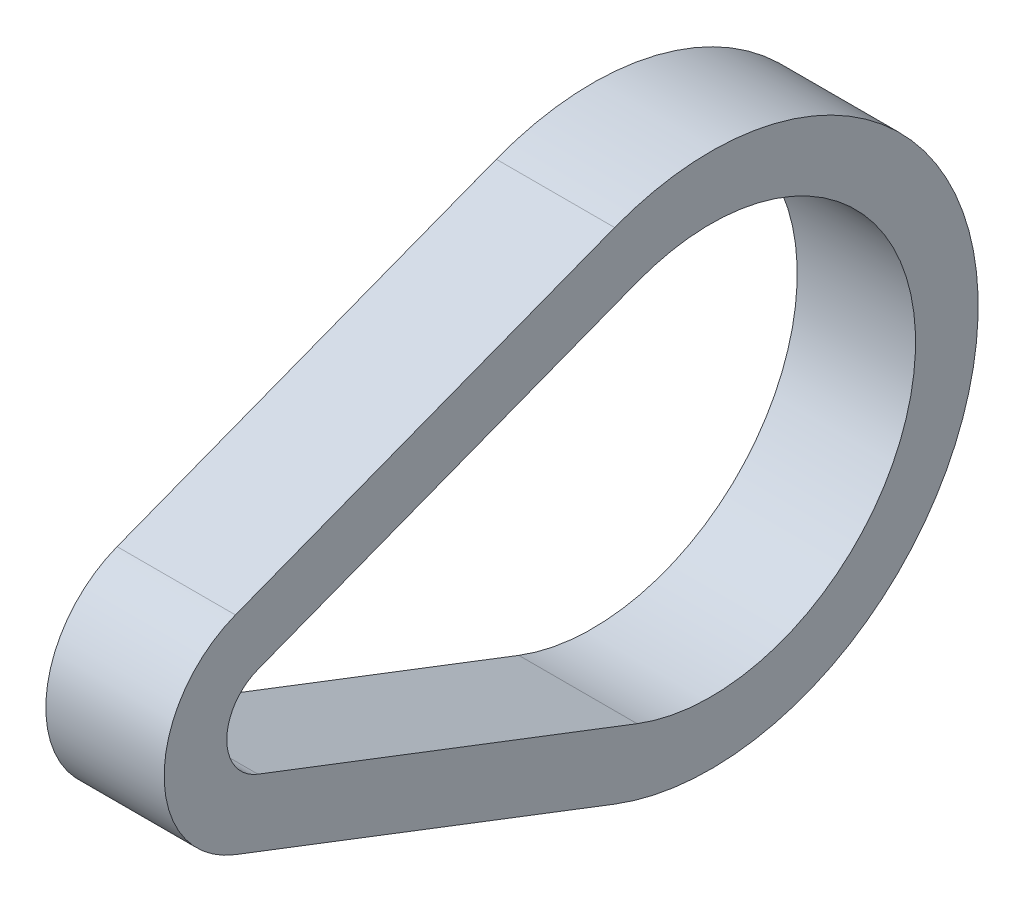
ISO-10303-21;
HEADER;
FILE_DESCRIPTION(('STEP AP214'),'2;1');
FILE_NAME('part.step','',(''),(''),'','','');
FILE_SCHEMA(('AUTOMOTIVE_DESIGN { 1 0 10303 214 1 1 1 1 }'));
ENDSEC;
DATA;
#1=APPLICATION_CONTEXT('core data for automotive mechanical design processes');
#2=APPLICATION_PROTOCOL_DEFINITION('international standard','automotive_design',2000,#1);
#3=PRODUCT_CONTEXT('',#1,'mechanical');
#4=PRODUCT('Part','Part','',(#3));
#5=PRODUCT_RELATED_PRODUCT_CATEGORY('part','',(#4));
#6=PRODUCT_DEFINITION_FORMATION('','',#4);
#7=PRODUCT_DEFINITION_CONTEXT('part definition',#1,'design');
#8=PRODUCT_DEFINITION('design','',#6,#7);
#9=PRODUCT_DEFINITION_SHAPE('','',#8);
#10=(LENGTH_UNIT() NAMED_UNIT(*) SI_UNIT(.MILLI.,.METRE.));
#11=(NAMED_UNIT(*) PLANE_ANGLE_UNIT() SI_UNIT($,.RADIAN.));
#12=(NAMED_UNIT(*) SI_UNIT($,.STERADIAN.) SOLID_ANGLE_UNIT());
#13=UNCERTAINTY_MEASURE_WITH_UNIT(LENGTH_MEASURE(1.E-05),#10,'distance_accuracy_value','');
#14=(GEOMETRIC_REPRESENTATION_CONTEXT(3) GLOBAL_UNCERTAINTY_ASSIGNED_CONTEXT((#13)) GLOBAL_UNIT_ASSIGNED_CONTEXT((#10,
#11,#12)) REPRESENTATION_CONTEXT('',''));
#15=CARTESIAN_POINT('',(0.,0.,0.));
#16=DIRECTION('',(0.,0.,1.));
#17=DIRECTION('',(1.,0.,0.));
#18=AXIS2_PLACEMENT_3D('',#15,#16,#17);
#19=CARTESIAN_POINT('',(3.,0.,0.));
#20=DIRECTION('',(1.,0.,0.));
#21=DIRECTION('',(0.,0.,-1.));
#22=AXIS2_PLACEMENT_3D('',#19,#20,#21);
#23=PLANE('',#22);
#24=CARTESIAN_POINT('',(3.,0.,0.));
#25=DIRECTION('',(1.,0.,0.));
#26=DIRECTION('',(0.,0.,-1.));
#27=AXIS2_PLACEMENT_3D('',#24,#25,#26);
#28=CIRCLE('',#27,5.6388);
#29=CARTESIAN_POINT('',(3.,5.26283144638713,2.02451737629459));
#30=VERTEX_POINT('',#29);
#31=CARTESIAN_POINT('',(3.,-5.26283144638713,2.02451737629459));
#32=VERTEX_POINT('',#31);
#33=EDGE_CURVE('E153',#30,#32,#28,.T.);
#34=ORIENTED_EDGE('',*,*,#33,.T.);
#35=DIRECTION('',(0.,-0.3590333716916,-0.933324722704677));
#36=VECTOR('',#35,1.);
#37=CARTESIAN_POINT('',(3.,-5.26283144638713,2.02451737629459));
#38=LINE('',#37,#36);
#39=CARTESIAN_POINT('',(3.,-12.6592432088772,-17.2028149597238));
#40=VERTEX_POINT('',#39);
#41=EDGE_CURVE('E157',#32,#40,#38,.T.);
#42=ORIENTED_EDGE('',*,*,#41,.T.);
#43=CARTESIAN_POINT('',(3.,0.,-22.0726));
#44=DIRECTION('',(1.,0.,0.));
#45=DIRECTION('',(0.,0.,-1.));
#46=AXIS2_PLACEMENT_3D('',#43,#44,#45);
#47=CIRCLE('',#46,13.5636);
#48=CARTESIAN_POINT('',(3.,12.6592432088772,-17.2028149597238));
#49=VERTEX_POINT('',#48);
#50=EDGE_CURVE('E161',#40,#49,#47,.T.);
#51=ORIENTED_EDGE('',*,*,#50,.T.);
#52=DIRECTION('',(0.,-0.3590333716916,0.933324722704677));
#53=VECTOR('',#52,1.);
#54=CARTESIAN_POINT('',(3.,5.26283144638713,2.02451737629459));
#55=LINE('',#54,#53);
#56=EDGE_CURVE('E164',#49,#30,#55,.T.);
#57=ORIENTED_EDGE('',*,*,#56,.T.);
#58=EDGE_LOOP('',(#34,#42,#51,#57));
#59=FACE_BOUND('',#58,.T.);
#60=DIRECTION('',(0.,-0.3590333716916,-0.933324722704677));
#61=VECTOR('',#60,1.);
#62=CARTESIAN_POINT('',(3.,-2.29952545179978,0.884586421173763));
#63=LINE('',#62,#61);
#64=CARTESIAN_POINT('',(3.,-2.29952545179978,0.884586421173763));
#65=VERTEX_POINT('',#64);
#66=CARTESIAN_POINT('',(3.,-9.69593721428981,-18.3427459148446));
#67=VERTEX_POINT('',#66);
#68=EDGE_CURVE('E114',#65,#67,#63,.T.);
#69=ORIENTED_EDGE('',*,*,#68,.F.);
#70=CARTESIAN_POINT('',(3.,0.,0.));
#71=DIRECTION('',(1.,0.,0.));
#72=DIRECTION('',(0.,0.,-1.));
#73=AXIS2_PLACEMENT_3D('',#70,#71,#72);
#74=CIRCLE('',#73,2.4638);
#75=CARTESIAN_POINT('',(3.,2.29952545179978,0.884586421173763));
#76=VERTEX_POINT('',#75);
#77=EDGE_CURVE('E105',#76,#65,#74,.T.);
#78=ORIENTED_EDGE('',*,*,#77,.F.);
#79=DIRECTION('',(0.,-0.3590333716916,0.933324722704677));
#80=VECTOR('',#79,1.);
#81=CARTESIAN_POINT('',(3.,2.29952545179978,0.884586421173763));
#82=LINE('',#81,#80);
#83=CARTESIAN_POINT('',(3.,9.69593721428981,-18.3427459148446));
#84=VERTEX_POINT('',#83);
#85=EDGE_CURVE('E131',#84,#76,#82,.T.);
#86=ORIENTED_EDGE('',*,*,#85,.F.);
#87=CARTESIAN_POINT('',(3.,0.,-22.0726));
#88=DIRECTION('',(1.,0.,0.));
#89=DIRECTION('',(0.,0.,-1.));
#90=AXIS2_PLACEMENT_3D('',#87,#88,#89);
#91=CIRCLE('',#90,10.3886);
#92=EDGE_CURVE('E127',#67,#84,#91,.T.);
#93=ORIENTED_EDGE('',*,*,#92,.F.);
#94=EDGE_LOOP('',(#69,#78,#86,#93));
#95=FACE_BOUND('',#94,.T.);
#96=ADVANCED_FACE('F39',(#59,#95),#23,.T.);
#97=CARTESIAN_POINT('',(-3.,0.,0.));
#98=DIRECTION('',(1.,0.,0.));
#99=DIRECTION('',(0.,0.,-1.));
#100=AXIS2_PLACEMENT_3D('',#97,#98,#99);
#101=PLANE('',#100);
#102=CARTESIAN_POINT('',(-3.,0.,0.));
#103=DIRECTION('',(1.,0.,0.));
#104=DIRECTION('',(0.,0.,-1.));
#105=AXIS2_PLACEMENT_3D('',#102,#103,#104);
#106=CIRCLE('',#105,5.6388);
#107=CARTESIAN_POINT('',(-3.,5.26283144638713,2.02451737629459));
#108=VERTEX_POINT('',#107);
#109=CARTESIAN_POINT('',(-3.,-5.26283144638713,2.02451737629459));
#110=VERTEX_POINT('',#109);
#111=EDGE_CURVE('E123',#108,#110,#106,.T.);
#112=ORIENTED_EDGE('',*,*,#111,.F.);
#113=DIRECTION('',(0.,-0.3590333716916,0.933324722704677));
#114=VECTOR('',#113,1.);
#115=CARTESIAN_POINT('',(-3.,5.26283144638713,2.02451737629459));
#116=LINE('',#115,#114);
#117=CARTESIAN_POINT('',(-3.,12.6592432088772,-17.2028149597238));
#118=VERTEX_POINT('',#117);
#119=EDGE_CURVE('E158',#118,#108,#116,.T.);
#120=ORIENTED_EDGE('',*,*,#119,.F.);
#121=CARTESIAN_POINT('',(-3.,0.,-22.0726));
#122=DIRECTION('',(1.,0.,0.));
#123=DIRECTION('',(0.,0.,-1.));
#124=AXIS2_PLACEMENT_3D('',#121,#122,#123);
#125=CIRCLE('',#124,13.5636);
#126=CARTESIAN_POINT('',(-3.,-12.6592432088772,-17.2028149597238));
#127=VERTEX_POINT('',#126);
#128=EDGE_CURVE('E174',#127,#118,#125,.T.);
#129=ORIENTED_EDGE('',*,*,#128,.F.);
#130=DIRECTION('',(0.,-0.3590333716916,-0.933324722704677));
#131=VECTOR('',#130,1.);
#132=CARTESIAN_POINT('',(-3.,-5.26283144638713,2.02451737629459));
#133=LINE('',#132,#131);
#134=EDGE_CURVE('E171',#110,#127,#133,.T.);
#135=ORIENTED_EDGE('',*,*,#134,.F.);
#136=EDGE_LOOP('',(#112,#120,#129,#135));
#137=FACE_BOUND('',#136,.T.);
#138=CARTESIAN_POINT('',(-3.,0.,0.));
#139=DIRECTION('',(1.,0.,0.));
#140=DIRECTION('',(0.,0.,-1.));
#141=AXIS2_PLACEMENT_3D('',#138,#139,#140);
#142=CIRCLE('',#141,2.4638);
#143=CARTESIAN_POINT('',(-3.,2.29952545179978,0.884586421173763));
#144=VERTEX_POINT('',#143);
#145=CARTESIAN_POINT('',(-3.,-2.29952545179978,0.884586421173763));
#146=VERTEX_POINT('',#145);
#147=EDGE_CURVE('E63',#144,#146,#142,.T.);
#148=ORIENTED_EDGE('',*,*,#147,.T.);
#149=DIRECTION('',(0.,-0.3590333716916,-0.933324722704677));
#150=VECTOR('',#149,1.);
#151=CARTESIAN_POINT('',(-3.,-2.29952545179978,0.884586421173763));
#152=LINE('',#151,#150);
#153=CARTESIAN_POINT('',(-3.,-9.69593721428981,-18.3427459148446));
#154=VERTEX_POINT('',#153);
#155=EDGE_CURVE('E121',#146,#154,#152,.T.);
#156=ORIENTED_EDGE('',*,*,#155,.T.);
#157=CARTESIAN_POINT('',(-3.,0.,-22.0726));
#158=DIRECTION('',(1.,0.,0.));
#159=DIRECTION('',(0.,0.,-1.));
#160=AXIS2_PLACEMENT_3D('',#157,#158,#159);
#161=CIRCLE('',#160,10.3886);
#162=CARTESIAN_POINT('',(-3.,9.69593721428981,-18.3427459148446));
#163=VERTEX_POINT('',#162);
#164=EDGE_CURVE('E140',#154,#163,#161,.T.);
#165=ORIENTED_EDGE('',*,*,#164,.T.);
#166=DIRECTION('',(0.,-0.3590333716916,0.933324722704677));
#167=VECTOR('',#166,1.);
#168=CARTESIAN_POINT('',(-3.,2.29952545179978,0.884586421173763));
#169=LINE('',#168,#167);
#170=EDGE_CURVE('E115',#163,#144,#169,.T.);
#171=ORIENTED_EDGE('',*,*,#170,.T.);
#172=EDGE_LOOP('',(#148,#156,#165,#171));
#173=FACE_BOUND('',#172,.T.);
#174=ADVANCED_FACE('F197',(#137,#173),#101,.F.);
#175=CARTESIAN_POINT('',(3.,0.,0.));
#176=DIRECTION('',(-1.,0.,0.));
#177=DIRECTION('',(0.,0.,1.));
#178=AXIS2_PLACEMENT_3D('',#175,#176,#177);
#179=CYLINDRICAL_SURFACE('',#178,5.6388);
#180=ORIENTED_EDGE('',*,*,#111,.T.);
#181=DIRECTION('',(-1.,0.,0.));
#182=VECTOR('',#181,1.);
#183=CARTESIAN_POINT('',(3.,-5.26283144638713,2.02451737629459));
#184=LINE('',#183,#182);
#185=EDGE_CURVE('E11',#32,#110,#184,.T.);
#186=ORIENTED_EDGE('',*,*,#185,.F.);
#187=ORIENTED_EDGE('',*,*,#33,.F.);
#188=DIRECTION('',(-1.,0.,0.));
#189=VECTOR('',#188,1.);
#190=CARTESIAN_POINT('',(3.,5.26283144638713,2.02451737629459));
#191=LINE('',#190,#189);
#192=EDGE_CURVE('E167',#30,#108,#191,.T.);
#193=ORIENTED_EDGE('',*,*,#192,.T.);
#194=EDGE_LOOP('',(#180,#186,#187,#193));
#195=FACE_BOUND('',#194,.T.);
#196=ADVANCED_FACE('F41',(#195),#179,.T.);
#197=CARTESIAN_POINT('',(3.,-5.26283144638713,2.02451737629459));
#198=DIRECTION('',(0.,0.933324722704677,-0.359033371691599));
#199=DIRECTION('',(0.,0.3590333716916,0.933324722704677));
#200=AXIS2_PLACEMENT_3D('',#197,#198,#199);
#201=PLANE('',#200);
#202=ORIENTED_EDGE('',*,*,#134,.T.);
#203=DIRECTION('',(-1.,0.,0.));
#204=VECTOR('',#203,1.);
#205=CARTESIAN_POINT('',(3.,-12.6592432088772,-17.2028149597238));
#206=LINE('',#205,#204);
#207=EDGE_CURVE('E48',#40,#127,#206,.T.);
#208=ORIENTED_EDGE('',*,*,#207,.F.);
#209=ORIENTED_EDGE('',*,*,#41,.F.);
#210=ORIENTED_EDGE('',*,*,#185,.T.);
#211=EDGE_LOOP('',(#202,#208,#209,#210));
#212=FACE_BOUND('',#211,.T.);
#213=ADVANCED_FACE('F207',(#212),#201,.F.);
#214=CARTESIAN_POINT('',(3.,0.,-22.0726));
#215=DIRECTION('',(-1.,0.,0.));
#216=DIRECTION('',(0.,0.,1.));
#217=AXIS2_PLACEMENT_3D('',#214,#215,#216);
#218=CYLINDRICAL_SURFACE('',#217,13.5636);
#219=ORIENTED_EDGE('',*,*,#128,.T.);
#220=DIRECTION('',(-1.,0.,0.));
#221=VECTOR('',#220,1.);
#222=CARTESIAN_POINT('',(3.,12.6592432088772,-17.2028149597238));
#223=LINE('',#222,#221);
#224=EDGE_CURVE('E182',#49,#118,#223,.T.);
#225=ORIENTED_EDGE('',*,*,#224,.F.);
#226=ORIENTED_EDGE('',*,*,#50,.F.);
#227=ORIENTED_EDGE('',*,*,#207,.T.);
#228=EDGE_LOOP('',(#219,#225,#226,#227));
#229=FACE_BOUND('',#228,.T.);
#230=ADVANCED_FACE('F191',(#229),#218,.T.);
#231=CARTESIAN_POINT('',(3.,5.26283144638713,2.02451737629459));
#232=DIRECTION('',(0.,-0.933324722704677,-0.3590333716916));
#233=DIRECTION('',(0.,0.3590333716916,-0.933324722704677));
#234=AXIS2_PLACEMENT_3D('',#231,#232,#233);
#235=PLANE('',#234);
#236=ORIENTED_EDGE('',*,*,#119,.T.);
#237=ORIENTED_EDGE('',*,*,#192,.F.);
#238=ORIENTED_EDGE('',*,*,#56,.F.);
#239=ORIENTED_EDGE('',*,*,#224,.T.);
#240=EDGE_LOOP('',(#236,#237,#238,#239));
#241=FACE_BOUND('',#240,.T.);
#242=ADVANCED_FACE('F201',(#241),#235,.F.);
#243=CARTESIAN_POINT('',(3.,0.,0.));
#244=DIRECTION('',(-1.,0.,0.));
#245=DIRECTION('',(0.,0.,1.));
#246=AXIS2_PLACEMENT_3D('',#243,#244,#245);
#247=CYLINDRICAL_SURFACE('',#246,2.4638);
#248=ORIENTED_EDGE('',*,*,#147,.F.);
#249=DIRECTION('',(-1.,0.,0.));
#250=VECTOR('',#249,1.);
#251=CARTESIAN_POINT('',(3.,2.29952545179978,0.884586421173763));
#252=LINE('',#251,#250);
#253=EDGE_CURVE('E109',#76,#144,#252,.T.);
#254=ORIENTED_EDGE('',*,*,#253,.F.);
#255=ORIENTED_EDGE('',*,*,#77,.T.);
#256=DIRECTION('',(-1.,0.,0.));
#257=VECTOR('',#256,1.);
#258=CARTESIAN_POINT('',(3.,-2.29952545179978,0.884586421173763));
#259=LINE('',#258,#257);
#260=EDGE_CURVE('E108',#65,#146,#259,.T.);
#261=ORIENTED_EDGE('',*,*,#260,.T.);
#262=EDGE_LOOP('',(#248,#254,#255,#261));
#263=FACE_BOUND('',#262,.T.);
#264=ADVANCED_FACE('F107',(#263),#247,.F.);
#265=CARTESIAN_POINT('',(3.,-2.29952545179978,0.884586421173763));
#266=DIRECTION('',(0.,0.933324722704677,-0.3590333716916));
#267=DIRECTION('',(0.,0.3590333716916,0.933324722704677));
#268=AXIS2_PLACEMENT_3D('',#265,#266,#267);
#269=PLANE('',#268);
#270=ORIENTED_EDGE('',*,*,#155,.F.);
#271=ORIENTED_EDGE('',*,*,#260,.F.);
#272=ORIENTED_EDGE('',*,*,#68,.T.);
#273=DIRECTION('',(-1.,0.,0.));
#274=VECTOR('',#273,1.);
#275=CARTESIAN_POINT('',(3.,-9.69593721428981,-18.3427459148446));
#276=LINE('',#275,#274);
#277=EDGE_CURVE('E124',#67,#154,#276,.T.);
#278=ORIENTED_EDGE('',*,*,#277,.T.);
#279=EDGE_LOOP('',(#270,#271,#272,#278));
#280=FACE_BOUND('',#279,.T.);
#281=ADVANCED_FACE('F118',(#280),#269,.T.);
#282=CARTESIAN_POINT('',(3.,0.,-22.0726));
#283=DIRECTION('',(-1.,0.,0.));
#284=DIRECTION('',(0.,0.,1.));
#285=AXIS2_PLACEMENT_3D('',#282,#283,#284);
#286=CYLINDRICAL_SURFACE('',#285,10.3886);
#287=ORIENTED_EDGE('',*,*,#164,.F.);
#288=ORIENTED_EDGE('',*,*,#277,.F.);
#289=ORIENTED_EDGE('',*,*,#92,.T.);
#290=DIRECTION('',(-1.,0.,0.));
#291=VECTOR('',#290,1.);
#292=CARTESIAN_POINT('',(3.,9.69593721428981,-18.3427459148446));
#293=LINE('',#292,#291);
#294=EDGE_CURVE('E55',#84,#163,#293,.T.);
#295=ORIENTED_EDGE('',*,*,#294,.T.);
#296=EDGE_LOOP('',(#287,#288,#289,#295));
#297=FACE_BOUND('',#296,.T.);
#298=ADVANCED_FACE('F230',(#297),#286,.F.);
#299=CARTESIAN_POINT('',(3.,2.29952545179978,0.884586421173763));
#300=DIRECTION('',(0.,-0.933324722704677,-0.3590333716916));
#301=DIRECTION('',(0.,0.3590333716916,-0.933324722704677));
#302=AXIS2_PLACEMENT_3D('',#299,#300,#301);
#303=PLANE('',#302);
#304=ORIENTED_EDGE('',*,*,#170,.F.);
#305=ORIENTED_EDGE('',*,*,#294,.F.);
#306=ORIENTED_EDGE('',*,*,#85,.T.);
#307=ORIENTED_EDGE('',*,*,#253,.T.);
#308=EDGE_LOOP('',(#304,#305,#306,#307));
#309=FACE_BOUND('',#308,.T.);
#310=ADVANCED_FACE('F234',(#309),#303,.T.);
#311=CLOSED_SHELL('',(#96,#174,#196,#213,#230,#242,#264,#281,#298,#310));
#312=MANIFOLD_SOLID_BREP('B2',#311);
#313=ADVANCED_BREP_SHAPE_REPRESENTATION('',(#18,#312),#14);
#314=SHAPE_DEFINITION_REPRESENTATION(#9,#313);
ENDSEC;
END-ISO-10303-21;
